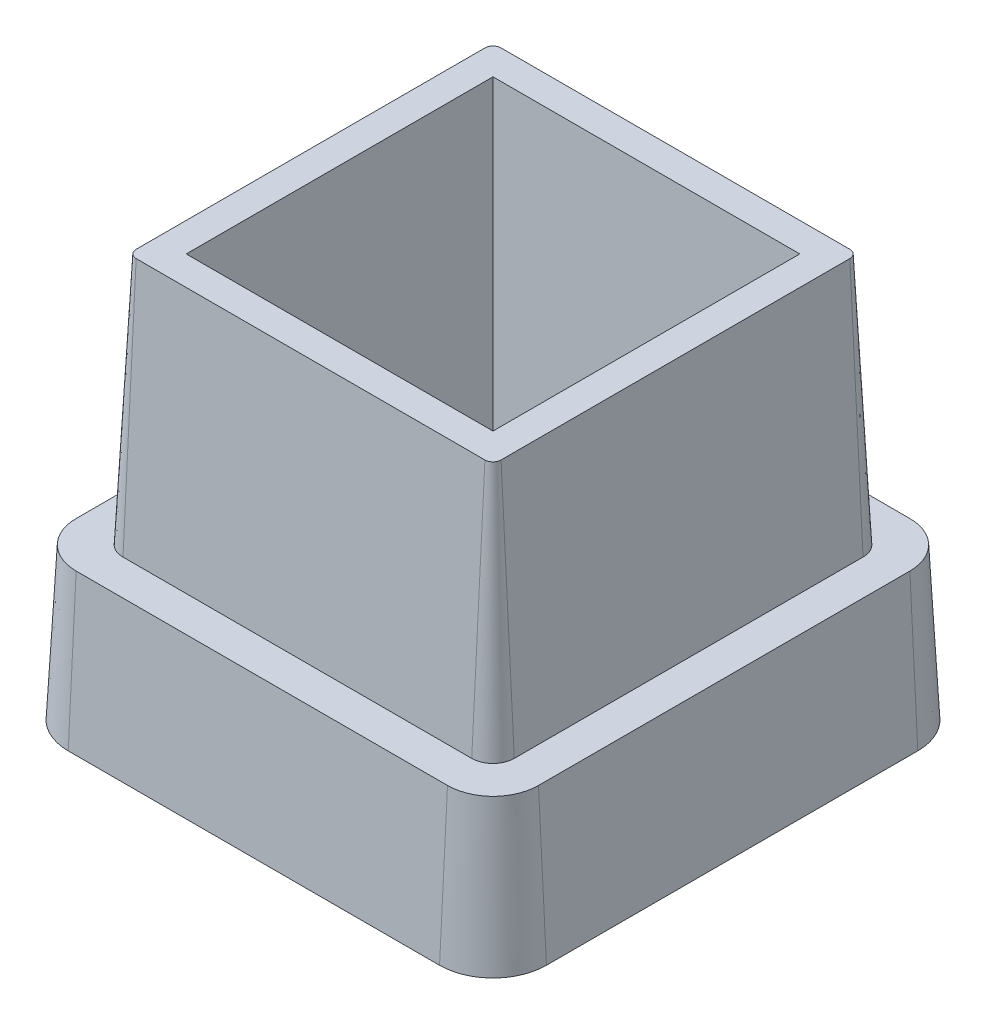
ISO-10303-21;
HEADER;
FILE_DESCRIPTION(('STEP AP214'),'2;1');
FILE_NAME('part.step','',(''),(''),'','','');
FILE_SCHEMA(('AUTOMOTIVE_DESIGN { 1 0 10303 214 1 1 1 1 }'));
ENDSEC;
DATA;
#1=APPLICATION_CONTEXT('core data for automotive mechanical design processes');
#2=APPLICATION_PROTOCOL_DEFINITION('international standard','automotive_design',2000,#1);
#3=PRODUCT_CONTEXT('',#1,'mechanical');
#4=PRODUCT('Part','Part','',(#3));
#5=PRODUCT_RELATED_PRODUCT_CATEGORY('part','',(#4));
#6=PRODUCT_DEFINITION_FORMATION('','',#4);
#7=PRODUCT_DEFINITION_CONTEXT('part definition',#1,'design');
#8=PRODUCT_DEFINITION('design','',#6,#7);
#9=PRODUCT_DEFINITION_SHAPE('','',#8);
#10=(LENGTH_UNIT() NAMED_UNIT(*) SI_UNIT(.MILLI.,.METRE.));
#11=(NAMED_UNIT(*) PLANE_ANGLE_UNIT() SI_UNIT($,.RADIAN.));
#12=(NAMED_UNIT(*) SI_UNIT($,.STERADIAN.) SOLID_ANGLE_UNIT());
#13=UNCERTAINTY_MEASURE_WITH_UNIT(LENGTH_MEASURE(1.E-05),#10,'distance_accuracy_value','');
#14=(GEOMETRIC_REPRESENTATION_CONTEXT(3) GLOBAL_UNCERTAINTY_ASSIGNED_CONTEXT((#13)) GLOBAL_UNIT_ASSIGNED_CONTEXT((#10,
#11,#12)) REPRESENTATION_CONTEXT('',''));
#15=CARTESIAN_POINT('',(0.,0.,0.));
#16=DIRECTION('',(0.,0.,1.));
#17=DIRECTION('',(1.,0.,0.));
#18=AXIS2_PLACEMENT_3D('',#15,#16,#17);
#19=CARTESIAN_POINT('',(-63.3432793684678,22.6740788715319,27.8818156877063));
#20=DIRECTION('',(-0.998629534754574,0.0523359562429439,0.));
#21=DIRECTION('',(-0.052335956242944,-0.998629534754574,0.));
#22=AXIS2_PLACEMENT_3D('',#19,#20,#21);
#23=PLANE('',#22);
#24=DIRECTION('',(0.,0.,-1.));
#25=VECTOR('',#24,1.);
#26=CARTESIAN_POINT('',(-64.6534738505438,-2.32592112846808,27.8818156877063));
#27=LINE('',#26,#25);
#28=CARTESIAN_POINT('',(-64.6534738505438,-2.32592112846808,16.3818156877063));
#29=VERTEX_POINT('',#28);
#30=CARTESIAN_POINT('',(-64.6534738505438,-2.32592112846808,39.3818156877064));
#31=VERTEX_POINT('',#30);
#32=EDGE_CURVE('E263',#29,#31,#27,.F.);
#33=ORIENTED_EDGE('',*,*,#32,.T.);
#34=DIRECTION('',(-0.0523359562429439,-0.998629534754574,0.));
#35=VECTOR('',#34,1.);
#36=CARTESIAN_POINT('',(-63.3432793684678,22.6740788715319,39.3818156877064));
#37=LINE('',#36,#35);
#38=CARTESIAN_POINT('',(-64.1608407252832,7.07407887153192,39.3818156877064));
#39=VERTEX_POINT('',#38);
#40=EDGE_CURVE('E215',#31,#39,#37,.F.);
#41=ORIENTED_EDGE('',*,*,#40,.T.);
#42=DIRECTION('',(0.,0.,-1.));
#43=VECTOR('',#42,1.);
#44=CARTESIAN_POINT('',(-64.1608407252832,7.07407887153192,27.8818156877063));
#45=LINE('',#44,#43);
#46=CARTESIAN_POINT('',(-64.1608407252832,7.07407887153192,16.3818156877063));
#47=VERTEX_POINT('',#46);
#48=EDGE_CURVE('E265',#47,#39,#45,.F.);
#49=ORIENTED_EDGE('',*,*,#48,.F.);
#50=DIRECTION('',(-0.0523359562429439,-0.998629534754574,0.));
#51=VECTOR('',#50,1.);
#52=CARTESIAN_POINT('',(-63.3432793684678,22.6740788715319,16.3818156877063));
#53=LINE('',#52,#51);
#54=EDGE_CURVE('E218',#47,#29,#53,.T.);
#55=ORIENTED_EDGE('',*,*,#54,.T.);
#56=EDGE_LOOP('',(#33,#41,#49,#55));
#57=FACE_BOUND('',#56,.T.);
#58=ADVANCED_FACE('F39',(#57),#23,.T.);
#59=CARTESIAN_POINT('',(-49.8432793684677,22.6740788715319,41.3818156877063));
#60=DIRECTION('',(0.,0.0523359562429439,0.998629534754574));
#61=DIRECTION('',(0.,-0.998629534754574,0.052335956242944));
#62=AXIS2_PLACEMENT_3D('',#59,#60,#61);
#63=PLANE('',#62);
#64=DIRECTION('',(-1.,0.,0.));
#65=VECTOR('',#64,1.);
#66=CARTESIAN_POINT('',(-49.8432793684677,7.07407887153192,42.1993770445218));
#67=LINE('',#66,#65);
#68=CARTESIAN_POINT('',(-61.3432793684678,7.07407887153192,42.1993770445218));
#69=VERTEX_POINT('',#68);
#70=CARTESIAN_POINT('',(-38.3432793684677,7.07407887153192,42.1993770445218));
#71=VERTEX_POINT('',#70);
#72=EDGE_CURVE('E258',#69,#71,#67,.F.);
#73=ORIENTED_EDGE('',*,*,#72,.F.);
#74=DIRECTION('',(0.,-0.998629534754574,0.0523359562429439));
#75=VECTOR('',#74,1.);
#76=CARTESIAN_POINT('',(-61.3432793684678,22.6740788715319,41.3818156877063));
#77=LINE('',#76,#75);
#78=CARTESIAN_POINT('',(-61.3432793684678,-2.32592112846808,42.6920101697824));
#79=VERTEX_POINT('',#78);
#80=EDGE_CURVE('E213',#69,#79,#77,.T.);
#81=ORIENTED_EDGE('',*,*,#80,.T.);
#82=DIRECTION('',(-1.,0.,0.));
#83=VECTOR('',#82,1.);
#84=CARTESIAN_POINT('',(-49.8432793684677,-2.32592112846808,42.6920101697824));
#85=LINE('',#84,#83);
#86=CARTESIAN_POINT('',(-38.3432793684677,-2.32592112846808,42.6920101697824));
#87=VERTEX_POINT('',#86);
#88=EDGE_CURVE('E277',#79,#87,#85,.F.);
#89=ORIENTED_EDGE('',*,*,#88,.T.);
#90=DIRECTION('',(0.,-0.998629534754574,0.0523359562429439));
#91=VECTOR('',#90,1.);
#92=CARTESIAN_POINT('',(-38.3432793684677,22.6740788715319,41.3818156877063));
#93=LINE('',#92,#91);
#94=EDGE_CURVE('E211',#87,#71,#93,.F.);
#95=ORIENTED_EDGE('',*,*,#94,.T.);
#96=EDGE_LOOP('',(#73,#81,#89,#95));
#97=FACE_BOUND('',#96,.T.);
#98=ADVANCED_FACE('F348',(#97),#63,.T.);
#99=CARTESIAN_POINT('',(-36.3432793684678,22.6740788715319,27.8818156877063));
#100=DIRECTION('',(0.998629534754574,0.0523359562429439,0.));
#101=DIRECTION('',(-0.052335956242944,0.998629534754574,0.));
#102=AXIS2_PLACEMENT_3D('',#99,#100,#101);
#103=PLANE('',#102);
#104=DIRECTION('',(0.,0.,1.));
#105=VECTOR('',#104,1.);
#106=CARTESIAN_POINT('',(-35.5257180116523,7.07407887153192,27.8818156877063));
#107=LINE('',#106,#105);
#108=CARTESIAN_POINT('',(-35.5257180116523,7.07407887153192,39.3818156877064));
#109=VERTEX_POINT('',#108);
#110=CARTESIAN_POINT('',(-35.5257180116523,7.07407887153192,16.3818156877063));
#111=VERTEX_POINT('',#110);
#112=EDGE_CURVE('E254',#109,#111,#107,.F.);
#113=ORIENTED_EDGE('',*,*,#112,.F.);
#114=DIRECTION('',(0.0523359562429439,-0.998629534754574,0.));
#115=VECTOR('',#114,1.);
#116=CARTESIAN_POINT('',(-36.3432793684678,22.6740788715319,39.3818156877064));
#117=LINE('',#116,#115);
#118=CARTESIAN_POINT('',(-35.0330848863917,-2.32592112846808,39.3818156877064));
#119=VERTEX_POINT('',#118);
#120=EDGE_CURVE('E209',#109,#119,#117,.T.);
#121=ORIENTED_EDGE('',*,*,#120,.T.);
#122=DIRECTION('',(0.,0.,1.));
#123=VECTOR('',#122,1.);
#124=CARTESIAN_POINT('',(-35.0330848863917,-2.32592112846808,27.8818156877063));
#125=LINE('',#124,#123);
#126=CARTESIAN_POINT('',(-35.0330848863917,-2.32592112846808,16.3818156877063));
#127=VERTEX_POINT('',#126);
#128=EDGE_CURVE('E273',#119,#127,#125,.F.);
#129=ORIENTED_EDGE('',*,*,#128,.T.);
#130=DIRECTION('',(0.0523359562429439,-0.998629534754574,0.));
#131=VECTOR('',#130,1.);
#132=CARTESIAN_POINT('',(-36.3432793684678,22.6740788715319,16.3818156877063));
#133=LINE('',#132,#131);
#134=EDGE_CURVE('E206',#127,#111,#133,.F.);
#135=ORIENTED_EDGE('',*,*,#134,.T.);
#136=EDGE_LOOP('',(#113,#121,#129,#135));
#137=FACE_BOUND('',#136,.T.);
#138=ADVANCED_FACE('F354',(#137),#103,.T.);
#139=CARTESIAN_POINT('',(-49.8432793684677,22.6740788715319,14.3818156877063));
#140=DIRECTION('',(0.,0.0523359562429439,-0.998629534754574));
#141=DIRECTION('',(0.,0.998629534754574,0.052335956242944));
#142=AXIS2_PLACEMENT_3D('',#139,#140,#141);
#143=PLANE('',#142);
#144=DIRECTION('',(1.,0.,0.));
#145=VECTOR('',#144,1.);
#146=CARTESIAN_POINT('',(-49.8432793684677,7.07407887153192,13.5642543308909));
#147=LINE('',#146,#145);
#148=CARTESIAN_POINT('',(-38.3432793684677,7.07407887153192,13.5642543308909));
#149=VERTEX_POINT('',#148);
#150=CARTESIAN_POINT('',(-61.3432793684678,7.07407887153192,13.5642543308909));
#151=VERTEX_POINT('',#150);
#152=EDGE_CURVE('E257',#149,#151,#147,.F.);
#153=ORIENTED_EDGE('',*,*,#152,.F.);
#154=DIRECTION('',(0.,-0.998629534754574,-0.0523359562429439));
#155=VECTOR('',#154,1.);
#156=CARTESIAN_POINT('',(-38.3432793684677,22.6740788715319,14.3818156877063));
#157=LINE('',#156,#155);
#158=CARTESIAN_POINT('',(-38.3432793684677,-2.32592112846808,13.0716212056303));
#159=VERTEX_POINT('',#158);
#160=EDGE_CURVE('E11',#149,#159,#157,.T.);
#161=ORIENTED_EDGE('',*,*,#160,.T.);
#162=DIRECTION('',(1.,0.,0.));
#163=VECTOR('',#162,1.);
#164=CARTESIAN_POINT('',(-49.8432793684677,-2.32592112846808,13.0716212056303));
#165=LINE('',#164,#163);
#166=CARTESIAN_POINT('',(-61.3432793684678,-2.32592112846808,13.0716212056303));
#167=VERTEX_POINT('',#166);
#168=EDGE_CURVE('E276',#159,#167,#165,.F.);
#169=ORIENTED_EDGE('',*,*,#168,.T.);
#170=DIRECTION('',(0.,-0.998629534754574,-0.0523359562429439));
#171=VECTOR('',#170,1.);
#172=CARTESIAN_POINT('',(-61.3432793684678,22.6740788715319,14.3818156877063));
#173=LINE('',#172,#171);
#174=EDGE_CURVE('E49',#167,#151,#173,.F.);
#175=ORIENTED_EDGE('',*,*,#174,.T.);
#176=EDGE_LOOP('',(#153,#161,#169,#175));
#177=FACE_BOUND('',#176,.T.);
#178=ADVANCED_FACE('F396',(#177),#143,.T.);
#179=CARTESIAN_POINT('',(-49.8432793684677,-2.32592112846808,27.8818156877063));
#180=DIRECTION('',(0.,1.,0.));
#181=DIRECTION('',(0.,0.,1.));
#182=AXIS2_PLACEMENT_3D('',#179,#180,#181);
#183=PLANE('',#182);
#184=ORIENTED_EDGE('',*,*,#88,.F.);
#185=CARTESIAN_POINT('',(-61.3432793684678,-2.32592112846808,39.3818156877064));
#186=DIRECTION('',(0.,1.,0.));
#187=DIRECTION('',(0.,0.,1.));
#188=AXIS2_PLACEMENT_3D('',#185,#186,#187);
#189=CIRCLE('',#188,3.31019448207603);
#190=EDGE_CURVE('E252',#79,#31,#189,.F.);
#191=ORIENTED_EDGE('',*,*,#190,.T.);
#192=ORIENTED_EDGE('',*,*,#32,.F.);
#193=CARTESIAN_POINT('',(-61.3432793684678,-2.32592112846808,16.3818156877063));
#194=DIRECTION('',(0.,1.,0.));
#195=DIRECTION('',(0.,0.,1.));
#196=AXIS2_PLACEMENT_3D('',#193,#194,#195);
#197=CIRCLE('',#196,3.31019448207603);
#198=EDGE_CURVE('E250',#29,#167,#197,.F.);
#199=ORIENTED_EDGE('',*,*,#198,.T.);
#200=ORIENTED_EDGE('',*,*,#168,.F.);
#201=CARTESIAN_POINT('',(-38.3432793684677,-2.32592112846808,16.3818156877063));
#202=DIRECTION('',(0.,1.,0.));
#203=DIRECTION('',(0.,0.,1.));
#204=AXIS2_PLACEMENT_3D('',#201,#202,#203);
#205=CIRCLE('',#204,3.31019448207603);
#206=EDGE_CURVE('E280',#159,#127,#205,.F.);
#207=ORIENTED_EDGE('',*,*,#206,.T.);
#208=ORIENTED_EDGE('',*,*,#128,.F.);
#209=CARTESIAN_POINT('',(-38.3432793684677,-2.32592112846808,39.3818156877064));
#210=DIRECTION('',(0.,1.,0.));
#211=DIRECTION('',(0.,0.,1.));
#212=AXIS2_PLACEMENT_3D('',#209,#210,#211);
#213=CIRCLE('',#212,3.31019448207603);
#214=EDGE_CURVE('E278',#119,#87,#213,.F.);
#215=ORIENTED_EDGE('',*,*,#214,.T.);
#216=EDGE_LOOP('',(#184,#191,#192,#199,#200,#207,#208,#215));
#217=FACE_BOUND('',#216,.T.);
#218=ADVANCED_FACE('F398',(#217),#183,.F.);
#219=CARTESIAN_POINT('',(-49.8432793684677,7.07407887153192,27.8818156877063));
#220=DIRECTION('',(0.,1.,0.));
#221=DIRECTION('',(0.,0.,1.));
#222=AXIS2_PLACEMENT_3D('',#219,#220,#221);
#223=PLANE('',#222);
#224=DIRECTION('',(0.,0.,1.));
#225=VECTOR('',#224,1.);
#226=CARTESIAN_POINT('',(-61.9608407252832,7.07407887153192,27.8818156877063));
#227=LINE('',#226,#225);
#228=CARTESIAN_POINT('',(-61.9608407252832,7.07407887153192,17.0818156877063));
#229=VERTEX_POINT('',#228);
#230=CARTESIAN_POINT('',(-61.9608407252832,7.07407887153192,38.6818156877063));
#231=VERTEX_POINT('',#230);
#232=EDGE_CURVE('E268',#229,#231,#227,.T.);
#233=ORIENTED_EDGE('',*,*,#232,.F.);
#234=CARTESIAN_POINT('',(-60.6432793684678,7.07407887153192,17.0818156877063));
#235=DIRECTION('',(0.,1.,0.));
#236=DIRECTION('',(0.,0.,1.));
#237=AXIS2_PLACEMENT_3D('',#234,#235,#236);
#238=CIRCLE('',#237,1.31756135681544);
#239=CARTESIAN_POINT('',(-60.6432793684678,7.07407887153192,15.7642543308909));
#240=VERTEX_POINT('',#239);
#241=EDGE_CURVE('E294',#229,#240,#238,.F.);
#242=ORIENTED_EDGE('',*,*,#241,.T.);
#243=DIRECTION('',(-1.,0.,0.));
#244=VECTOR('',#243,1.);
#245=CARTESIAN_POINT('',(-49.8432793684677,7.07407887153192,15.7642543308909));
#246=LINE('',#245,#244);
#247=CARTESIAN_POINT('',(-39.0432793684678,7.07407887153192,15.7642543308909));
#248=VERTEX_POINT('',#247);
#249=EDGE_CURVE('E297',#248,#240,#246,.T.);
#250=ORIENTED_EDGE('',*,*,#249,.F.);
#251=CARTESIAN_POINT('',(-39.0432793684678,7.07407887153192,17.0818156877063));
#252=DIRECTION('',(0.,1.,0.));
#253=DIRECTION('',(0.,0.,1.));
#254=AXIS2_PLACEMENT_3D('',#251,#252,#253);
#255=CIRCLE('',#254,1.31756135681544);
#256=CARTESIAN_POINT('',(-37.7257180116523,7.07407887153192,17.0818156877063));
#257=VERTEX_POINT('',#256);
#258=EDGE_CURVE('E214',#248,#257,#255,.F.);
#259=ORIENTED_EDGE('',*,*,#258,.T.);
#260=DIRECTION('',(0.,0.,-1.));
#261=VECTOR('',#260,1.);
#262=CARTESIAN_POINT('',(-37.7257180116523,7.07407887153192,27.8818156877063));
#263=LINE('',#262,#261);
#264=CARTESIAN_POINT('',(-37.7257180116523,7.07407887153192,38.6818156877063));
#265=VERTEX_POINT('',#264);
#266=EDGE_CURVE('E300',#265,#257,#263,.T.);
#267=ORIENTED_EDGE('',*,*,#266,.F.);
#268=CARTESIAN_POINT('',(-39.0432793684678,7.07407887153192,38.6818156877063));
#269=DIRECTION('',(0.,1.,0.));
#270=DIRECTION('',(0.,0.,1.));
#271=AXIS2_PLACEMENT_3D('',#268,#269,#270);
#272=CIRCLE('',#271,1.31756135681544);
#273=CARTESIAN_POINT('',(-39.0432793684678,7.07407887153192,39.9993770445218));
#274=VERTEX_POINT('',#273);
#275=EDGE_CURVE('E296',#265,#274,#272,.F.);
#276=ORIENTED_EDGE('',*,*,#275,.T.);
#277=DIRECTION('',(1.,0.,0.));
#278=VECTOR('',#277,1.);
#279=CARTESIAN_POINT('',(-49.8432793684677,7.07407887153192,39.9993770445218));
#280=LINE('',#279,#278);
#281=CARTESIAN_POINT('',(-60.6432793684678,7.07407887153192,39.9993770445218));
#282=VERTEX_POINT('',#281);
#283=EDGE_CURVE('E304',#282,#274,#280,.T.);
#284=ORIENTED_EDGE('',*,*,#283,.F.);
#285=CARTESIAN_POINT('',(-60.6432793684678,7.07407887153192,38.6818156877063));
#286=DIRECTION('',(0.,1.,0.));
#287=DIRECTION('',(0.,0.,1.));
#288=AXIS2_PLACEMENT_3D('',#285,#286,#287);
#289=CIRCLE('',#288,1.31756135681544);
#290=EDGE_CURVE('E292',#282,#231,#289,.F.);
#291=ORIENTED_EDGE('',*,*,#290,.T.);
#292=EDGE_LOOP('',(#233,#242,#250,#259,#267,#276,#284,#291));
#293=FACE_BOUND('',#292,.T.);
#294=ORIENTED_EDGE('',*,*,#48,.T.);
#295=CARTESIAN_POINT('',(-61.3432793684678,7.07407887153192,39.3818156877064));
#296=DIRECTION('',(0.,1.,0.));
#297=DIRECTION('',(0.,0.,1.));
#298=AXIS2_PLACEMENT_3D('',#295,#296,#297);
#299=CIRCLE('',#298,2.81756135681544);
#300=EDGE_CURVE('E210',#39,#69,#299,.T.);
#301=ORIENTED_EDGE('',*,*,#300,.T.);
#302=ORIENTED_EDGE('',*,*,#72,.T.);
#303=CARTESIAN_POINT('',(-38.3432793684677,7.07407887153192,39.3818156877064));
#304=DIRECTION('',(0.,1.,0.));
#305=DIRECTION('',(0.,0.,1.));
#306=AXIS2_PLACEMENT_3D('',#303,#304,#305);
#307=CIRCLE('',#306,2.81756135681544);
#308=EDGE_CURVE('E261',#71,#109,#307,.T.);
#309=ORIENTED_EDGE('',*,*,#308,.T.);
#310=ORIENTED_EDGE('',*,*,#112,.T.);
#311=CARTESIAN_POINT('',(-38.3432793684677,7.07407887153192,16.3818156877063));
#312=DIRECTION('',(0.,1.,0.));
#313=DIRECTION('',(0.,0.,1.));
#314=AXIS2_PLACEMENT_3D('',#311,#312,#313);
#315=CIRCLE('',#314,2.81756135681544);
#316=EDGE_CURVE('E259',#111,#149,#315,.T.);
#317=ORIENTED_EDGE('',*,*,#316,.T.);
#318=ORIENTED_EDGE('',*,*,#152,.T.);
#319=CARTESIAN_POINT('',(-61.3432793684678,7.07407887153192,16.3818156877063));
#320=DIRECTION('',(0.,1.,0.));
#321=DIRECTION('',(0.,0.,1.));
#322=AXIS2_PLACEMENT_3D('',#319,#320,#321);
#323=CIRCLE('',#322,2.81756135681544);
#324=EDGE_CURVE('E217',#151,#47,#323,.T.);
#325=ORIENTED_EDGE('',*,*,#324,.T.);
#326=EDGE_LOOP('',(#294,#301,#302,#309,#310,#317,#318,#325));
#327=FACE_BOUND('',#326,.T.);
#328=ADVANCED_FACE('F387',(#293,#327),#223,.T.);
#329=CARTESIAN_POINT('',(-49.8432793684677,22.6740788715319,39.1818156877063));
#330=DIRECTION('',(0.,0.0523359562429439,0.998629534754574));
#331=DIRECTION('',(0.,-0.998629534754574,0.052335956242944));
#332=AXIS2_PLACEMENT_3D('',#329,#330,#331);
#333=PLANE('',#332);
#334=DIRECTION('',(1.,0.,0.));
#335=VECTOR('',#334,1.);
#336=CARTESIAN_POINT('',(-49.8432793684677,22.6740788715319,39.1818156877063));
#337=LINE('',#336,#335);
#338=CARTESIAN_POINT('',(-60.6432793684678,22.6740788715319,39.1818156877063));
#339=VERTEX_POINT('',#338);
#340=CARTESIAN_POINT('',(-39.0432793684678,22.6740788715319,39.1818156877063));
#341=VERTEX_POINT('',#340);
#342=EDGE_CURVE('E313',#339,#341,#337,.T.);
#343=ORIENTED_EDGE('',*,*,#342,.F.);
#344=DIRECTION('',(0.,-0.998629534754574,0.0523359562429439));
#345=VECTOR('',#344,1.);
#346=CARTESIAN_POINT('',(-60.6432793684678,22.6740788715319,39.1818156877063));
#347=LINE('',#346,#345);
#348=EDGE_CURVE('E230',#339,#282,#347,.T.);
#349=ORIENTED_EDGE('',*,*,#348,.T.);
#350=ORIENTED_EDGE('',*,*,#283,.T.);
#351=DIRECTION('',(0.,-0.998629534754574,0.0523359562429439));
#352=VECTOR('',#351,1.);
#353=CARTESIAN_POINT('',(-39.0432793684678,22.6740788715319,39.1818156877063));
#354=LINE('',#353,#352);
#355=EDGE_CURVE('E228',#274,#341,#354,.F.);
#356=ORIENTED_EDGE('',*,*,#355,.T.);
#357=EDGE_LOOP('',(#343,#349,#350,#356));
#358=FACE_BOUND('',#357,.T.);
#359=ADVANCED_FACE('F365',(#358),#333,.T.);
#360=CARTESIAN_POINT('',(-61.1432793684678,22.6740788715319,27.8818156877063));
#361=DIRECTION('',(-0.998629534754574,0.0523359562429439,0.));
#362=DIRECTION('',(-0.052335956242944,-0.998629534754574,0.));
#363=AXIS2_PLACEMENT_3D('',#360,#361,#362);
#364=PLANE('',#363);
#365=ORIENTED_EDGE('',*,*,#232,.T.);
#366=DIRECTION('',(-0.0523359562429439,-0.998629534754574,0.));
#367=VECTOR('',#366,1.);
#368=CARTESIAN_POINT('',(-61.1432793684678,22.6740788715319,38.6818156877063));
#369=LINE('',#368,#367);
#370=CARTESIAN_POINT('',(-61.1432793684678,22.6740788715319,38.6818156877063));
#371=VERTEX_POINT('',#370);
#372=EDGE_CURVE('E224',#231,#371,#369,.F.);
#373=ORIENTED_EDGE('',*,*,#372,.T.);
#374=DIRECTION('',(0.,0.,1.));
#375=VECTOR('',#374,1.);
#376=CARTESIAN_POINT('',(-61.1432793684678,22.6740788715319,27.8818156877063));
#377=LINE('',#376,#375);
#378=CARTESIAN_POINT('',(-61.1432793684678,22.6740788715319,17.0818156877063));
#379=VERTEX_POINT('',#378);
#380=EDGE_CURVE('E307',#379,#371,#377,.T.);
#381=ORIENTED_EDGE('',*,*,#380,.F.);
#382=DIRECTION('',(-0.0523359562429439,-0.998629534754574,0.));
#383=VECTOR('',#382,1.);
#384=CARTESIAN_POINT('',(-61.1432793684678,22.6740788715319,17.0818156877063));
#385=LINE('',#384,#383);
#386=EDGE_CURVE('E227',#379,#229,#385,.T.);
#387=ORIENTED_EDGE('',*,*,#386,.T.);
#388=EDGE_LOOP('',(#365,#373,#381,#387));
#389=FACE_BOUND('',#388,.T.);
#390=ADVANCED_FACE('F361',(#389),#364,.T.);
#391=CARTESIAN_POINT('',(-49.8432793684677,22.6740788715319,16.5818156877063));
#392=DIRECTION('',(0.,0.0523359562429439,-0.998629534754574));
#393=DIRECTION('',(0.,0.998629534754574,0.052335956242944));
#394=AXIS2_PLACEMENT_3D('',#391,#392,#393);
#395=PLANE('',#394);
#396=ORIENTED_EDGE('',*,*,#249,.T.);
#397=DIRECTION('',(0.,-0.998629534754574,-0.0523359562429439));
#398=VECTOR('',#397,1.);
#399=CARTESIAN_POINT('',(-60.6432793684678,22.6740788715319,16.5818156877063));
#400=LINE('',#399,#398);
#401=CARTESIAN_POINT('',(-60.6432793684678,22.6740788715319,16.5818156877063));
#402=VERTEX_POINT('',#401);
#403=EDGE_CURVE('E220',#240,#402,#400,.F.);
#404=ORIENTED_EDGE('',*,*,#403,.T.);
#405=DIRECTION('',(-1.,0.,0.));
#406=VECTOR('',#405,1.);
#407=CARTESIAN_POINT('',(-49.8432793684677,22.6740788715319,16.5818156877063));
#408=LINE('',#407,#406);
#409=CARTESIAN_POINT('',(-39.0432793684678,22.6740788715319,16.5818156877063));
#410=VERTEX_POINT('',#409);
#411=EDGE_CURVE('E312',#410,#402,#408,.T.);
#412=ORIENTED_EDGE('',*,*,#411,.F.);
#413=DIRECTION('',(0.,-0.998629534754574,-0.0523359562429439));
#414=VECTOR('',#413,1.);
#415=CARTESIAN_POINT('',(-39.0432793684678,22.6740788715319,16.5818156877063));
#416=LINE('',#415,#414);
#417=EDGE_CURVE('E223',#410,#248,#416,.T.);
#418=ORIENTED_EDGE('',*,*,#417,.T.);
#419=EDGE_LOOP('',(#396,#404,#412,#418));
#420=FACE_BOUND('',#419,.T.);
#421=ADVANCED_FACE('F364',(#420),#395,.T.);
#422=CARTESIAN_POINT('',(-38.5432793684678,22.6740788715319,27.8818156877063));
#423=DIRECTION('',(0.998629534754574,0.0523359562429439,0.));
#424=DIRECTION('',(-0.052335956242944,0.998629534754574,0.));
#425=AXIS2_PLACEMENT_3D('',#422,#423,#424);
#426=PLANE('',#425);
#427=DIRECTION('',(0.,0.,-1.));
#428=VECTOR('',#427,1.);
#429=CARTESIAN_POINT('',(-38.5432793684678,22.6740788715319,27.8818156877063));
#430=LINE('',#429,#428);
#431=CARTESIAN_POINT('',(-38.5432793684678,22.6740788715319,38.6818156877063));
#432=VERTEX_POINT('',#431);
#433=CARTESIAN_POINT('',(-38.5432793684678,22.6740788715319,17.0818156877063));
#434=VERTEX_POINT('',#433);
#435=EDGE_CURVE('E315',#432,#434,#430,.T.);
#436=ORIENTED_EDGE('',*,*,#435,.F.);
#437=DIRECTION('',(0.0523359562429439,-0.998629534754574,0.));
#438=VECTOR('',#437,1.);
#439=CARTESIAN_POINT('',(-38.5432793684678,22.6740788715319,38.6818156877063));
#440=LINE('',#439,#438);
#441=EDGE_CURVE('E290',#432,#265,#440,.T.);
#442=ORIENTED_EDGE('',*,*,#441,.T.);
#443=ORIENTED_EDGE('',*,*,#266,.T.);
#444=DIRECTION('',(0.0523359562429439,-0.998629534754574,0.));
#445=VECTOR('',#444,1.);
#446=CARTESIAN_POINT('',(-38.5432793684678,22.6740788715319,17.0818156877063));
#447=LINE('',#446,#445);
#448=EDGE_CURVE('E43',#257,#434,#447,.F.);
#449=ORIENTED_EDGE('',*,*,#448,.T.);
#450=EDGE_LOOP('',(#436,#442,#443,#449));
#451=FACE_BOUND('',#450,.T.);
#452=ADVANCED_FACE('F343',(#451),#426,.T.);
#453=CARTESIAN_POINT('',(-49.8432793684677,22.6740788715319,27.8818156877063));
#454=DIRECTION('',(0.,1.,0.));
#455=DIRECTION('',(0.,0.,1.));
#456=AXIS2_PLACEMENT_3D('',#453,#454,#455);
#457=PLANE('',#456);
#458=DIRECTION('',(0.,0.,-1.));
#459=VECTOR('',#458,1.);
#460=CARTESIAN_POINT('',(-59.3432793684677,22.6740788715319,27.8818156877063));
#461=LINE('',#460,#459);
#462=CARTESIAN_POINT('',(-59.3432793684677,22.6740788715319,18.3818156877063));
#463=VERTEX_POINT('',#462);
#464=CARTESIAN_POINT('',(-59.3432793684677,22.6740788715319,37.3818156877064));
#465=VERTEX_POINT('',#464);
#466=EDGE_CURVE('E327',#463,#465,#461,.F.);
#467=ORIENTED_EDGE('',*,*,#466,.F.);
#468=DIRECTION('',(1.,0.,0.));
#469=VECTOR('',#468,1.);
#470=CARTESIAN_POINT('',(-49.8432793684677,22.6740788715319,18.3818156877063));
#471=LINE('',#470,#469);
#472=CARTESIAN_POINT('',(-40.3432793684678,22.6740788715319,18.3818156877063));
#473=VERTEX_POINT('',#472);
#474=EDGE_CURVE('E202',#473,#463,#471,.F.);
#475=ORIENTED_EDGE('',*,*,#474,.F.);
#476=DIRECTION('',(0.,0.,1.));
#477=VECTOR('',#476,1.);
#478=CARTESIAN_POINT('',(-40.3432793684678,22.6740788715319,27.8818156877063));
#479=LINE('',#478,#477);
#480=CARTESIAN_POINT('',(-40.3432793684678,22.6740788715319,37.3818156877063));
#481=VERTEX_POINT('',#480);
#482=EDGE_CURVE('E324',#481,#473,#479,.F.);
#483=ORIENTED_EDGE('',*,*,#482,.F.);
#484=DIRECTION('',(-1.,0.,0.));
#485=VECTOR('',#484,1.);
#486=CARTESIAN_POINT('',(-49.8432793684677,22.6740788715319,37.3818156877063));
#487=LINE('',#486,#485);
#488=EDGE_CURVE('E185',#465,#481,#487,.F.);
#489=ORIENTED_EDGE('',*,*,#488,.F.);
#490=EDGE_LOOP('',(#467,#475,#483,#489));
#491=FACE_BOUND('',#490,.T.);
#492=ORIENTED_EDGE('',*,*,#380,.T.);
#493=CARTESIAN_POINT('',(-60.6432793684678,22.6740788715319,38.6818156877063));
#494=DIRECTION('',(0.,1.,0.));
#495=DIRECTION('',(0.,0.,1.));
#496=AXIS2_PLACEMENT_3D('',#493,#494,#495);
#497=CIRCLE('',#496,0.5);
#498=EDGE_CURVE('E231',#371,#339,#497,.T.);
#499=ORIENTED_EDGE('',*,*,#498,.T.);
#500=ORIENTED_EDGE('',*,*,#342,.T.);
#501=CARTESIAN_POINT('',(-39.0432793684678,22.6740788715319,38.6818156877063));
#502=DIRECTION('',(0.,1.,0.));
#503=DIRECTION('',(0.,0.,1.));
#504=AXIS2_PLACEMENT_3D('',#501,#502,#503);
#505=CIRCLE('',#504,0.5);
#506=EDGE_CURVE('E242',#341,#432,#505,.T.);
#507=ORIENTED_EDGE('',*,*,#506,.T.);
#508=ORIENTED_EDGE('',*,*,#435,.T.);
#509=CARTESIAN_POINT('',(-39.0432793684678,22.6740788715319,17.0818156877063));
#510=DIRECTION('',(0.,1.,0.));
#511=DIRECTION('',(0.,0.,1.));
#512=AXIS2_PLACEMENT_3D('',#509,#510,#511);
#513=CIRCLE('',#512,0.5);
#514=EDGE_CURVE('E226',#434,#410,#513,.T.);
#515=ORIENTED_EDGE('',*,*,#514,.T.);
#516=ORIENTED_EDGE('',*,*,#411,.T.);
#517=CARTESIAN_POINT('',(-60.6432793684678,22.6740788715319,17.0818156877063));
#518=DIRECTION('',(0.,1.,0.));
#519=DIRECTION('',(0.,0.,1.));
#520=AXIS2_PLACEMENT_3D('',#517,#518,#519);
#521=CIRCLE('',#520,0.5);
#522=EDGE_CURVE('E238',#402,#379,#521,.T.);
#523=ORIENTED_EDGE('',*,*,#522,.T.);
#524=EDGE_LOOP('',(#492,#499,#500,#507,#508,#515,#516,#523));
#525=FACE_BOUND('',#524,.T.);
#526=ADVANCED_FACE('F336',(#491,#525),#457,.T.);
#527=CARTESIAN_POINT('',(-59.3432793684677,22.6740788715319,27.8818156877063));
#528=DIRECTION('',(0.998629534754574,0.0523359562429439,0.));
#529=DIRECTION('',(-0.052335956242944,0.998629534754574,0.));
#530=AXIS2_PLACEMENT_3D('',#527,#528,#529);
#531=PLANE('',#530);
#532=ORIENTED_EDGE('',*,*,#466,.T.);
#533=DIRECTION('',(-0.052264427688714,0.997264688634237,0.052264427688714));
#534=VECTOR('',#533,1.);
#535=CARTESIAN_POINT('',(-59.3173294496523,22.1789249235784,37.3558657688909));
#536=LINE('',#535,#534);
#537=CARTESIAN_POINT('',(-58.1483820008144,-0.125921128468078,36.186918320053));
#538=VERTEX_POINT('',#537);
#539=EDGE_CURVE('E173',#538,#465,#536,.T.);
#540=ORIENTED_EDGE('',*,*,#539,.F.);
#541=DIRECTION('',(0.,0.,-1.));
#542=VECTOR('',#541,1.);
#543=CARTESIAN_POINT('',(-58.1483820008144,-0.125921128468078,27.8818156877063));
#544=LINE('',#543,#542);
#545=CARTESIAN_POINT('',(-58.1483820008144,-0.125921128468078,19.5767130553597));
#546=VERTEX_POINT('',#545);
#547=EDGE_CURVE('E200',#546,#538,#544,.F.);
#548=ORIENTED_EDGE('',*,*,#547,.F.);
#549=DIRECTION('',(-0.052264427688714,0.997264688634237,-0.052264427688714));
#550=VECTOR('',#549,1.);
#551=CARTESIAN_POINT('',(-59.3173294496523,22.1789249235784,18.4077656065218));
#552=LINE('',#551,#550);
#553=EDGE_CURVE('E316',#546,#463,#552,.T.);
#554=ORIENTED_EDGE('',*,*,#553,.T.);
#555=EDGE_LOOP('',(#532,#540,#548,#554));
#556=FACE_BOUND('',#555,.T.);
#557=ADVANCED_FACE('F334',(#556),#531,.T.);
#558=CARTESIAN_POINT('',(-49.8432793684677,22.6740788715319,18.3818156877063));
#559=DIRECTION('',(0.,0.0523359562429439,0.998629534754574));
#560=DIRECTION('',(0.,-0.998629534754574,0.052335956242944));
#561=AXIS2_PLACEMENT_3D('',#558,#559,#560);
#562=PLANE('',#561);
#563=ORIENTED_EDGE('',*,*,#474,.T.);
#564=ORIENTED_EDGE('',*,*,#553,.F.);
#565=DIRECTION('',(1.,0.,0.));
#566=VECTOR('',#565,1.);
#567=CARTESIAN_POINT('',(-49.8432793684677,-0.125921128468078,19.5767130553597));
#568=LINE('',#567,#566);
#569=CARTESIAN_POINT('',(-41.5381767361211,-0.125921128468078,19.5767130553597));
#570=VERTEX_POINT('',#569);
#571=EDGE_CURVE('E197',#570,#546,#568,.F.);
#572=ORIENTED_EDGE('',*,*,#571,.F.);
#573=DIRECTION('',(0.052264427688714,0.997264688634237,-0.052264427688714));
#574=VECTOR('',#573,1.);
#575=CARTESIAN_POINT('',(-40.3692292872832,22.1789249235784,18.4077656065218));
#576=LINE('',#575,#574);
#577=EDGE_CURVE('E189',#570,#473,#576,.T.);
#578=ORIENTED_EDGE('',*,*,#577,.T.);
#579=EDGE_LOOP('',(#563,#564,#572,#578));
#580=FACE_BOUND('',#579,.T.);
#581=ADVANCED_FACE('F331',(#580),#562,.T.);
#582=CARTESIAN_POINT('',(-40.3432793684678,22.6740788715319,27.8818156877063));
#583=DIRECTION('',(-0.998629534754574,0.0523359562429439,0.));
#584=DIRECTION('',(-0.052335956242944,-0.998629534754574,0.));
#585=AXIS2_PLACEMENT_3D('',#582,#583,#584);
#586=PLANE('',#585);
#587=ORIENTED_EDGE('',*,*,#482,.T.);
#588=ORIENTED_EDGE('',*,*,#577,.F.);
#589=DIRECTION('',(0.,0.,1.));
#590=VECTOR('',#589,1.);
#591=CARTESIAN_POINT('',(-41.5381767361211,-0.125921128468078,27.8818156877063));
#592=LINE('',#591,#590);
#593=CARTESIAN_POINT('',(-41.5381767361211,-0.125921128468078,36.186918320053));
#594=VERTEX_POINT('',#593);
#595=EDGE_CURVE('E192',#594,#570,#592,.F.);
#596=ORIENTED_EDGE('',*,*,#595,.F.);
#597=DIRECTION('',(0.052264427688714,0.997264688634237,0.052264427688714));
#598=VECTOR('',#597,1.);
#599=CARTESIAN_POINT('',(-40.3692292872832,22.1789249235784,37.3558657688909));
#600=LINE('',#599,#598);
#601=EDGE_CURVE('E178',#594,#481,#600,.T.);
#602=ORIENTED_EDGE('',*,*,#601,.T.);
#603=EDGE_LOOP('',(#587,#588,#596,#602));
#604=FACE_BOUND('',#603,.T.);
#605=ADVANCED_FACE('F193',(#604),#586,.T.);
#606=CARTESIAN_POINT('',(-49.8432793684677,22.6740788715319,37.3818156877063));
#607=DIRECTION('',(0.,0.0523359562429439,-0.998629534754574));
#608=DIRECTION('',(0.,0.998629534754574,0.052335956242944));
#609=AXIS2_PLACEMENT_3D('',#606,#607,#608);
#610=PLANE('',#609);
#611=ORIENTED_EDGE('',*,*,#488,.T.);
#612=ORIENTED_EDGE('',*,*,#601,.F.);
#613=DIRECTION('',(-1.,0.,0.));
#614=VECTOR('',#613,1.);
#615=CARTESIAN_POINT('',(-49.8432793684677,-0.125921128468078,36.186918320053));
#616=LINE('',#615,#614);
#617=EDGE_CURVE('E182',#538,#594,#616,.F.);
#618=ORIENTED_EDGE('',*,*,#617,.F.);
#619=ORIENTED_EDGE('',*,*,#539,.T.);
#620=EDGE_LOOP('',(#611,#612,#618,#619));
#621=FACE_BOUND('',#620,.T.);
#622=ADVANCED_FACE('F180',(#621),#610,.T.);
#623=CARTESIAN_POINT('',(-49.8432793684677,-0.125921128468078,27.8818156877063));
#624=DIRECTION('',(0.,1.,0.));
#625=DIRECTION('',(0.,0.,1.));
#626=AXIS2_PLACEMENT_3D('',#623,#624,#625);
#627=PLANE('',#626);
#628=ORIENTED_EDGE('',*,*,#547,.T.);
#629=ORIENTED_EDGE('',*,*,#617,.T.);
#630=ORIENTED_EDGE('',*,*,#595,.T.);
#631=ORIENTED_EDGE('',*,*,#571,.T.);
#632=EDGE_LOOP('',(#628,#629,#630,#631));
#633=FACE_BOUND('',#632,.T.);
#634=ADVANCED_FACE('F199',(#633),#627,.T.);
#635=CARTESIAN_POINT('',(-60.6432793684678,22.6740788715319,38.6818156877063));
#636=DIRECTION('',(0.,-1.,0.));
#637=DIRECTION('',(0.,0.,1.));
#638=AXIS2_PLACEMENT_3D('',#635,#636,#637);
#639=CONICAL_SURFACE('',#638,0.5,0.05235987755983);
#640=ORIENTED_EDGE('',*,*,#290,.F.);
#641=ORIENTED_EDGE('',*,*,#348,.F.);
#642=ORIENTED_EDGE('',*,*,#498,.F.);
#643=ORIENTED_EDGE('',*,*,#372,.F.);
#644=EDGE_LOOP('',(#640,#641,#642,#643));
#645=FACE_BOUND('',#644,.T.);
#646=ADVANCED_FACE('F367',(#645),#639,.T.);
#647=CARTESIAN_POINT('',(-60.6432793684678,22.6740788715319,17.0818156877063));
#648=DIRECTION('',(0.,-1.,0.));
#649=DIRECTION('',(0.,0.,1.));
#650=AXIS2_PLACEMENT_3D('',#647,#648,#649);
#651=CONICAL_SURFACE('',#650,0.5,0.05235987755983);
#652=ORIENTED_EDGE('',*,*,#241,.F.);
#653=ORIENTED_EDGE('',*,*,#386,.F.);
#654=ORIENTED_EDGE('',*,*,#522,.F.);
#655=ORIENTED_EDGE('',*,*,#403,.F.);
#656=EDGE_LOOP('',(#652,#653,#654,#655));
#657=FACE_BOUND('',#656,.T.);
#658=ADVANCED_FACE('F370',(#657),#651,.T.);
#659=CARTESIAN_POINT('',(-39.0432793684678,22.6740788715319,38.6818156877063));
#660=DIRECTION('',(0.,-1.,0.));
#661=DIRECTION('',(0.,0.,1.));
#662=AXIS2_PLACEMENT_3D('',#659,#660,#661);
#663=CONICAL_SURFACE('',#662,0.5,0.05235987755983);
#664=ORIENTED_EDGE('',*,*,#275,.F.);
#665=ORIENTED_EDGE('',*,*,#441,.F.);
#666=ORIENTED_EDGE('',*,*,#506,.F.);
#667=ORIENTED_EDGE('',*,*,#355,.F.);
#668=EDGE_LOOP('',(#664,#665,#666,#667));
#669=FACE_BOUND('',#668,.T.);
#670=ADVANCED_FACE('F381',(#669),#663,.T.);
#671=CARTESIAN_POINT('',(-39.0432793684678,22.6740788715319,17.0818156877063));
#672=DIRECTION('',(0.,-1.,0.));
#673=DIRECTION('',(0.,0.,1.));
#674=AXIS2_PLACEMENT_3D('',#671,#672,#673);
#675=CONICAL_SURFACE('',#674,0.5,0.05235987755983);
#676=ORIENTED_EDGE('',*,*,#258,.F.);
#677=ORIENTED_EDGE('',*,*,#417,.F.);
#678=ORIENTED_EDGE('',*,*,#514,.F.);
#679=ORIENTED_EDGE('',*,*,#448,.F.);
#680=EDGE_LOOP('',(#676,#677,#678,#679));
#681=FACE_BOUND('',#680,.T.);
#682=ADVANCED_FACE('F375',(#681),#675,.T.);
#683=CARTESIAN_POINT('',(-61.3432793684678,22.6740788715319,39.3818156877064));
#684=DIRECTION('',(0.,-1.,0.));
#685=DIRECTION('',(0.,0.,1.));
#686=AXIS2_PLACEMENT_3D('',#683,#684,#685);
#687=CONICAL_SURFACE('',#686,2.,0.05235987755983);
#688=ORIENTED_EDGE('',*,*,#300,.F.);
#689=ORIENTED_EDGE('',*,*,#40,.F.);
#690=ORIENTED_EDGE('',*,*,#190,.F.);
#691=ORIENTED_EDGE('',*,*,#80,.F.);
#692=EDGE_LOOP('',(#688,#689,#690,#691));
#693=FACE_BOUND('',#692,.T.);
#694=ADVANCED_FACE('F372',(#693),#687,.T.);
#695=CARTESIAN_POINT('',(-38.3432793684677,22.6740788715319,39.3818156877064));
#696=DIRECTION('',(0.,-1.,0.));
#697=DIRECTION('',(0.,0.,1.));
#698=AXIS2_PLACEMENT_3D('',#695,#696,#697);
#699=CONICAL_SURFACE('',#698,2.,0.05235987755983);
#700=ORIENTED_EDGE('',*,*,#308,.F.);
#701=ORIENTED_EDGE('',*,*,#94,.F.);
#702=ORIENTED_EDGE('',*,*,#214,.F.);
#703=ORIENTED_EDGE('',*,*,#120,.F.);
#704=EDGE_LOOP('',(#700,#701,#702,#703));
#705=FACE_BOUND('',#704,.T.);
#706=ADVANCED_FACE('F374',(#705),#699,.T.);
#707=CARTESIAN_POINT('',(-38.3432793684677,22.6740788715319,16.3818156877063));
#708=DIRECTION('',(0.,-1.,0.));
#709=DIRECTION('',(0.,0.,1.));
#710=AXIS2_PLACEMENT_3D('',#707,#708,#709);
#711=CONICAL_SURFACE('',#710,2.,0.05235987755983);
#712=ORIENTED_EDGE('',*,*,#316,.F.);
#713=ORIENTED_EDGE('',*,*,#134,.F.);
#714=ORIENTED_EDGE('',*,*,#206,.F.);
#715=ORIENTED_EDGE('',*,*,#160,.F.);
#716=EDGE_LOOP('',(#712,#713,#714,#715));
#717=FACE_BOUND('',#716,.T.);
#718=ADVANCED_FACE('F41',(#717),#711,.T.);
#719=CARTESIAN_POINT('',(-61.3432793684678,22.6740788715319,16.3818156877063));
#720=DIRECTION('',(0.,-1.,0.));
#721=DIRECTION('',(0.,0.,1.));
#722=AXIS2_PLACEMENT_3D('',#719,#720,#721);
#723=CONICAL_SURFACE('',#722,2.,0.05235987755983);
#724=ORIENTED_EDGE('',*,*,#324,.F.);
#725=ORIENTED_EDGE('',*,*,#174,.F.);
#726=ORIENTED_EDGE('',*,*,#198,.F.);
#727=ORIENTED_EDGE('',*,*,#54,.F.);
#728=EDGE_LOOP('',(#724,#725,#726,#727));
#729=FACE_BOUND('',#728,.T.);
#730=ADVANCED_FACE('F359',(#729),#723,.T.);
#731=CLOSED_SHELL('',(#58,#98,#138,#178,#218,#328,#359,#390,#421,#452,#526,#557,#581,#605,#622,
#634,#646,#658,#670,#682,#694,#706,#718,#730));
#732=MANIFOLD_SOLID_BREP('B2',#731);
#733=ADVANCED_BREP_SHAPE_REPRESENTATION('',(#18,#732),#14);
#734=SHAPE_DEFINITION_REPRESENTATION(#9,#733);
ENDSEC;
END-ISO-10303-21;
